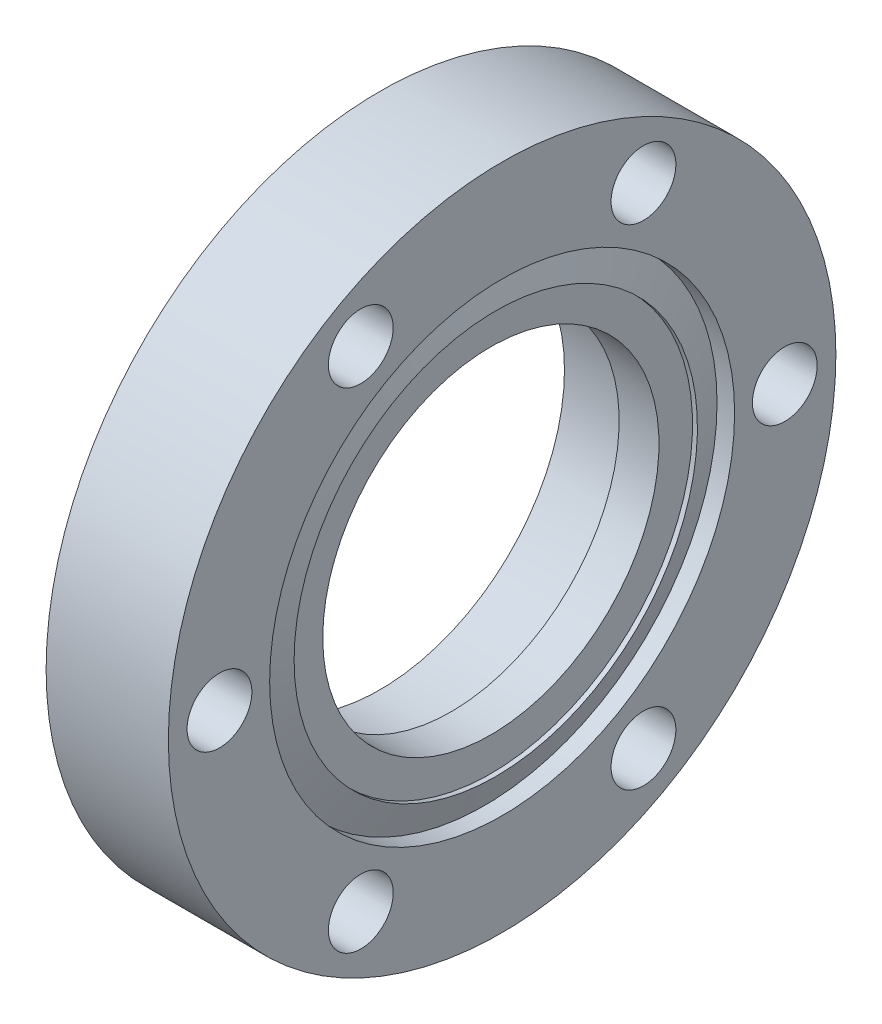
ISO-10303-21;
HEADER;
FILE_DESCRIPTION(('STEP AP214'),'2;1');
FILE_NAME('part.step','',(''),(''),'','','');
FILE_SCHEMA(('AUTOMOTIVE_DESIGN { 1 0 10303 214 1 1 1 1 }'));
ENDSEC;
DATA;
#1=APPLICATION_CONTEXT('core data for automotive mechanical design processes');
#2=APPLICATION_PROTOCOL_DEFINITION('international standard','automotive_design',2000,#1);
#3=PRODUCT_CONTEXT('',#1,'mechanical');
#4=PRODUCT('Part','Part','',(#3));
#5=PRODUCT_RELATED_PRODUCT_CATEGORY('part','',(#4));
#6=PRODUCT_DEFINITION_FORMATION('','',#4);
#7=PRODUCT_DEFINITION_CONTEXT('part definition',#1,'design');
#8=PRODUCT_DEFINITION('design','',#6,#7);
#9=PRODUCT_DEFINITION_SHAPE('','',#8);
#10=(LENGTH_UNIT() NAMED_UNIT(*) SI_UNIT(.MILLI.,.METRE.));
#11=(NAMED_UNIT(*) PLANE_ANGLE_UNIT() SI_UNIT($,.RADIAN.));
#12=(NAMED_UNIT(*) SI_UNIT($,.STERADIAN.) SOLID_ANGLE_UNIT());
#13=UNCERTAINTY_MEASURE_WITH_UNIT(LENGTH_MEASURE(1.E-05),#10,'distance_accuracy_value','');
#14=(GEOMETRIC_REPRESENTATION_CONTEXT(3) GLOBAL_UNCERTAINTY_ASSIGNED_CONTEXT((#13)) GLOBAL_UNIT_ASSIGNED_CONTEXT((#10,
#11,#12)) REPRESENTATION_CONTEXT('',''));
#15=CARTESIAN_POINT('',(0.,0.,0.));
#16=DIRECTION('',(0.,0.,1.));
#17=DIRECTION('',(1.,0.,0.));
#18=AXIS2_PLACEMENT_3D('',#15,#16,#17);
#19=CARTESIAN_POINT('',(5.18000000000051,-19.2062500000005,0.));
#20=DIRECTION('',(1.,0.,0.));
#21=DIRECTION('',(0.,0.,-1.));
#22=AXIS2_PLACEMENT_3D('',#19,#20,#21);
#23=PLANE('',#22);
#24=CARTESIAN_POINT('',(5.18000000000051,0.,0.));
#25=DIRECTION('',(-1.,0.,0.));
#26=DIRECTION('',(0.,0.,1.));
#27=AXIS2_PLACEMENT_3D('',#24,#25,#26);
#28=CIRCLE('',#27,17.4625);
#29=CARTESIAN_POINT('',(5.18000000000051,0.,17.4625));
#30=VERTEX_POINT('',#29);
#31=EDGE_CURVE('E18',#30,#30,#28,.T.);
#32=ORIENTED_EDGE('',*,*,#31,.T.);
#33=EDGE_LOOP('',(#32));
#34=FACE_BOUND('',#33,.T.);
#35=CARTESIAN_POINT('',(5.18000000000051,0.,0.));
#36=DIRECTION('',(-1.,0.,0.));
#37=DIRECTION('',(0.,0.,1.));
#38=AXIS2_PLACEMENT_3D('',#35,#36,#37);
#39=CIRCLE('',#38,20.950000000001);
#40=CARTESIAN_POINT('',(5.18000000000051,0.,20.950000000001));
#41=VERTEX_POINT('',#40);
#42=EDGE_CURVE('E81',#41,#41,#39,.F.);
#43=ORIENTED_EDGE('',*,*,#42,.T.);
#44=EDGE_LOOP('',(#43));
#45=FACE_BOUND('',#44,.T.);
#46=ADVANCED_FACE('F14',(#34,#45),#23,.T.);
#47=CARTESIAN_POINT('',(3.11069999999995,0.,0.));
#48=DIRECTION('',(-1.,0.,0.));
#49=DIRECTION('',(0.,0.,1.));
#50=AXIS2_PLACEMENT_3D('',#47,#48,#49);
#51=CYLINDRICAL_SURFACE('',#50,17.4625);
#52=CARTESIAN_POINT('',(1.04139999999939,0.,0.));
#53=DIRECTION('',(-1.,0.,0.));
#54=DIRECTION('',(0.,0.,1.));
#55=AXIS2_PLACEMENT_3D('',#52,#53,#54);
#56=CIRCLE('',#55,17.4625);
#57=CARTESIAN_POINT('',(1.04139999999939,0.,17.4625));
#58=VERTEX_POINT('',#57);
#59=EDGE_CURVE('E79',#58,#58,#56,.F.);
#60=ORIENTED_EDGE('',*,*,#59,.F.);
#61=EDGE_LOOP('',(#60));
#62=FACE_BOUND('',#61,.T.);
#63=ORIENTED_EDGE('',*,*,#31,.F.);
#64=EDGE_LOOP('',(#63));
#65=FACE_BOUND('',#64,.T.);
#66=ADVANCED_FACE('F89',(#62,#65),#51,.F.);
#67=CARTESIAN_POINT('',(5.43499999999988,0.,0.));
#68=DIRECTION('',(-1.,0.,0.));
#69=DIRECTION('',(0.,0.,1.));
#70=AXIS2_PLACEMENT_3D('',#67,#68,#69);
#71=CYLINDRICAL_SURFACE('',#70,20.950000000001);
#72=ORIENTED_EDGE('',*,*,#42,.F.);
#73=EDGE_LOOP('',(#72));
#74=FACE_BOUND('',#73,.T.);
#75=CARTESIAN_POINT('',(5.69000000223288,0.,0.));
#76=DIRECTION('',(-1.,0.,0.));
#77=DIRECTION('',(0.,-1.,0.));
#78=AXIS2_PLACEMENT_3D('',#75,#76,#77);
#79=CIRCLE('',#78,20.950000000814);
#80=CARTESIAN_POINT('',(5.69000000223288,-20.950000000814,0.));
#81=VERTEX_POINT('',#80);
#82=EDGE_CURVE('E78',#81,#81,#79,.T.);
#83=ORIENTED_EDGE('',*,*,#82,.F.);
#84=EDGE_LOOP('',(#83));
#85=FACE_BOUND('',#84,.T.);
#86=ADVANCED_FACE('F91',(#74,#85),#71,.F.);
#87=CARTESIAN_POINT('',(1.04139999999939,-18.3197499999999,0.));
#88=DIRECTION('',(-1.,0.,0.));
#89=DIRECTION('',(0.,0.,1.));
#90=AXIS2_PLACEMENT_3D('',#87,#88,#89);
#91=PLANE('',#90);
#92=ORIENTED_EDGE('',*,*,#59,.T.);
#93=EDGE_LOOP('',(#92));
#94=FACE_BOUND('',#93,.T.);
#95=CARTESIAN_POINT('',(1.04139999999939,0.,0.));
#96=DIRECTION('',(-1.,0.,0.));
#97=DIRECTION('',(0.,0.,1.));
#98=AXIS2_PLACEMENT_3D('',#95,#96,#97);
#99=CIRCLE('',#98,19.1769999999999);
#100=CARTESIAN_POINT('',(1.04139999999939,0.,19.1769999999999));
#101=VERTEX_POINT('',#100);
#102=EDGE_CURVE('E75',#101,#101,#99,.T.);
#103=ORIENTED_EDGE('',*,*,#102,.T.);
#104=EDGE_LOOP('',(#103));
#105=FACE_BOUND('',#104,.T.);
#106=ADVANCED_FACE('F100',(#94,#105),#91,.T.);
#107=CARTESIAN_POINT('',(4.52529524811392,0.,0.));
#108=DIRECTION('',(-1.,0.,0.));
#109=DIRECTION('',(0.,0.,1.));
#110=AXIS2_PLACEMENT_3D('',#107,#108,#109);
#111=CONICAL_SURFACE('',#110,24.1499999991873,1.22173047499998);
#112=ORIENTED_EDGE('',*,*,#82,.T.);
#113=EDGE_LOOP('',(#112));
#114=FACE_BOUND('',#113,.T.);
#115=CARTESIAN_POINT('',(4.52529525034756,0.,0.));
#116=DIRECTION('',(-1.,0.,0.));
#117=DIRECTION('',(0.,0.,1.));
#118=AXIS2_PLACEMENT_3D('',#115,#116,#117);
#119=CIRCLE('',#118,24.1500000000003);
#120=CARTESIAN_POINT('',(4.52529525034756,0.,24.1500000000003));
#121=VERTEX_POINT('',#120);
#122=EDGE_CURVE('E74',#121,#121,#119,.F.);
#123=ORIENTED_EDGE('',*,*,#122,.T.);
#124=EDGE_LOOP('',(#123));
#125=FACE_BOUND('',#124,.T.);
#126=ADVANCED_FACE('F130',(#114,#125),#111,.T.);
#127=CARTESIAN_POINT('',(-2.65429999999995,0.,0.));
#128=DIRECTION('',(-1.,0.,0.));
#129=DIRECTION('',(0.,0.,1.));
#130=AXIS2_PLACEMENT_3D('',#127,#128,#129);
#131=CYLINDRICAL_SURFACE('',#130,19.1769999999999);
#132=CARTESIAN_POINT('',(-6.34999999999929,0.,0.));
#133=DIRECTION('',(-1.,0.,0.));
#134=DIRECTION('',(0.,0.,1.));
#135=AXIS2_PLACEMENT_3D('',#132,#133,#134);
#136=CIRCLE('',#135,19.1769999999999);
#137=CARTESIAN_POINT('',(-6.34999999999929,0.,19.1769999999999));
#138=VERTEX_POINT('',#137);
#139=EDGE_CURVE('E53',#138,#138,#136,.F.);
#140=ORIENTED_EDGE('',*,*,#139,.F.);
#141=EDGE_LOOP('',(#140));
#142=FACE_BOUND('',#141,.T.);
#143=ORIENTED_EDGE('',*,*,#102,.F.);
#144=EDGE_LOOP('',(#143));
#145=FACE_BOUND('',#144,.T.);
#146=ADVANCED_FACE('F126',(#142,#145),#131,.F.);
#147=CARTESIAN_POINT('',(6.34999999999939,-25.4285843160799,14.6811999999998));
#148=DIRECTION('',(-1.,0.,0.));
#149=DIRECTION('',(0.,0.,1.));
#150=AXIS2_PLACEMENT_3D('',#147,#148,#149);
#151=CYLINDRICAL_SURFACE('',#150,3.36550000000002);
#152=CARTESIAN_POINT('',(6.34999999999937,-25.4285843160799,14.6811999999998));
#153=DIRECTION('',(-1.,0.,0.));
#154=DIRECTION('',(0.,0.,1.));
#155=AXIS2_PLACEMENT_3D('',#152,#153,#154);
#156=CIRCLE('',#155,3.36550000000002);
#157=CARTESIAN_POINT('',(6.34999999999937,-25.4285843160799,18.0466999999999));
#158=VERTEX_POINT('',#157);
#159=EDGE_CURVE('E50',#158,#158,#156,.T.);
#160=ORIENTED_EDGE('',*,*,#159,.F.);
#161=EDGE_LOOP('',(#160));
#162=FACE_BOUND('',#161,.T.);
#163=CARTESIAN_POINT('',(-6.34999999999929,-25.4285843160799,14.6811999999998));
#164=DIRECTION('',(-1.,0.,0.));
#165=DIRECTION('',(0.,0.,1.));
#166=AXIS2_PLACEMENT_3D('',#163,#164,#165);
#167=CIRCLE('',#166,3.36550000000002);
#168=CARTESIAN_POINT('',(-6.34999999999929,-25.4285843160799,18.0466999999999));
#169=VERTEX_POINT('',#168);
#170=EDGE_CURVE('E71',#169,#169,#167,.F.);
#171=ORIENTED_EDGE('',*,*,#170,.F.);
#172=EDGE_LOOP('',(#171));
#173=FACE_BOUND('',#172,.T.);
#174=ADVANCED_FACE('F129',(#162,#173),#151,.F.);
#175=CARTESIAN_POINT('',(6.34999999999939,0.,29.3623999999996));
#176=DIRECTION('',(-1.,0.,0.));
#177=DIRECTION('',(0.,0.,1.));
#178=AXIS2_PLACEMENT_3D('',#175,#176,#177);
#179=CYLINDRICAL_SURFACE('',#178,3.3655);
#180=CARTESIAN_POINT('',(6.34999999999937,0.,29.3623999999996));
#181=DIRECTION('',(-1.,0.,0.));
#182=DIRECTION('',(0.,0.,1.));
#183=AXIS2_PLACEMENT_3D('',#180,#181,#182);
#184=CIRCLE('',#183,3.3655);
#185=CARTESIAN_POINT('',(6.34999999999937,0.,32.7278999999996));
#186=VERTEX_POINT('',#185);
#187=EDGE_CURVE('E47',#186,#186,#184,.T.);
#188=ORIENTED_EDGE('',*,*,#187,.F.);
#189=EDGE_LOOP('',(#188));
#190=FACE_BOUND('',#189,.T.);
#191=CARTESIAN_POINT('',(-6.34999999999929,0.,29.3623999999996));
#192=DIRECTION('',(-1.,0.,0.));
#193=DIRECTION('',(0.,0.,1.));
#194=AXIS2_PLACEMENT_3D('',#191,#192,#193);
#195=CIRCLE('',#194,3.3655);
#196=CARTESIAN_POINT('',(-6.34999999999929,0.,32.7278999999996));
#197=VERTEX_POINT('',#196);
#198=EDGE_CURVE('E68',#197,#197,#195,.F.);
#199=ORIENTED_EDGE('',*,*,#198,.F.);
#200=EDGE_LOOP('',(#199));
#201=FACE_BOUND('',#200,.T.);
#202=ADVANCED_FACE('F214',(#190,#201),#179,.F.);
#203=CARTESIAN_POINT('',(6.34999999999939,25.4285843160799,14.6811999999998));
#204=DIRECTION('',(-1.,0.,0.));
#205=DIRECTION('',(0.,0.,1.));
#206=AXIS2_PLACEMENT_3D('',#203,#204,#205);
#207=CYLINDRICAL_SURFACE('',#206,3.36549999999999);
#208=CARTESIAN_POINT('',(6.34999999999937,25.4285843160799,14.6811999999998));
#209=DIRECTION('',(-1.,0.,0.));
#210=DIRECTION('',(0.,0.,1.));
#211=AXIS2_PLACEMENT_3D('',#208,#209,#210);
#212=CIRCLE('',#211,3.36549999999999);
#213=CARTESIAN_POINT('',(6.34999999999937,25.4285843160799,18.0466999999998));
#214=VERTEX_POINT('',#213);
#215=EDGE_CURVE('E44',#214,#214,#212,.T.);
#216=ORIENTED_EDGE('',*,*,#215,.F.);
#217=EDGE_LOOP('',(#216));
#218=FACE_BOUND('',#217,.T.);
#219=CARTESIAN_POINT('',(-6.34999999999929,25.4285843160799,14.6811999999998));
#220=DIRECTION('',(-1.,0.,0.));
#221=DIRECTION('',(0.,0.,1.));
#222=AXIS2_PLACEMENT_3D('',#219,#220,#221);
#223=CIRCLE('',#222,3.36549999999999);
#224=CARTESIAN_POINT('',(-6.34999999999929,25.4285843160799,18.0466999999998));
#225=VERTEX_POINT('',#224);
#226=EDGE_CURVE('E65',#225,#225,#223,.F.);
#227=ORIENTED_EDGE('',*,*,#226,.F.);
#228=EDGE_LOOP('',(#227));
#229=FACE_BOUND('',#228,.T.);
#230=ADVANCED_FACE('F223',(#218,#229),#207,.F.);
#231=CARTESIAN_POINT('',(6.34999999999939,25.4285843160799,-14.6811999999998));
#232=DIRECTION('',(-1.,0.,0.));
#233=DIRECTION('',(0.,0.,1.));
#234=AXIS2_PLACEMENT_3D('',#231,#232,#233);
#235=CYLINDRICAL_SURFACE('',#234,3.3655);
#236=CARTESIAN_POINT('',(6.34999999999937,25.4285843160799,-14.6811999999998));
#237=DIRECTION('',(-1.,0.,0.));
#238=DIRECTION('',(0.,0.,1.));
#239=AXIS2_PLACEMENT_3D('',#236,#237,#238);
#240=CIRCLE('',#239,3.3655);
#241=CARTESIAN_POINT('',(6.34999999999937,25.4285843160799,-11.3156999999998));
#242=VERTEX_POINT('',#241);
#243=EDGE_CURVE('E41',#242,#242,#240,.T.);
#244=ORIENTED_EDGE('',*,*,#243,.F.);
#245=EDGE_LOOP('',(#244));
#246=FACE_BOUND('',#245,.T.);
#247=CARTESIAN_POINT('',(-6.34999999999929,25.4285843160799,-14.6811999999998));
#248=DIRECTION('',(-1.,0.,0.));
#249=DIRECTION('',(0.,0.,1.));
#250=AXIS2_PLACEMENT_3D('',#247,#248,#249);
#251=CIRCLE('',#250,3.3655);
#252=CARTESIAN_POINT('',(-6.34999999999929,25.4285843160799,-11.3156999999998));
#253=VERTEX_POINT('',#252);
#254=EDGE_CURVE('E62',#253,#253,#251,.F.);
#255=ORIENTED_EDGE('',*,*,#254,.F.);
#256=EDGE_LOOP('',(#255));
#257=FACE_BOUND('',#256,.T.);
#258=ADVANCED_FACE('F232',(#246,#257),#235,.F.);
#259=CARTESIAN_POINT('',(6.34999999999939,-25.4285843160799,-14.6811999999998));
#260=DIRECTION('',(-1.,0.,0.));
#261=DIRECTION('',(0.,0.,1.));
#262=AXIS2_PLACEMENT_3D('',#259,#260,#261);
#263=CYLINDRICAL_SURFACE('',#262,3.3655);
#264=CARTESIAN_POINT('',(6.34999999999937,-25.4285843160799,-14.6811999999998));
#265=DIRECTION('',(-1.,0.,0.));
#266=DIRECTION('',(0.,0.,1.));
#267=AXIS2_PLACEMENT_3D('',#264,#265,#266);
#268=CIRCLE('',#267,3.3655);
#269=CARTESIAN_POINT('',(6.34999999999937,-25.4285843160799,-11.3156999999998));
#270=VERTEX_POINT('',#269);
#271=EDGE_CURVE('E38',#270,#270,#268,.T.);
#272=ORIENTED_EDGE('',*,*,#271,.F.);
#273=EDGE_LOOP('',(#272));
#274=FACE_BOUND('',#273,.T.);
#275=CARTESIAN_POINT('',(-6.34999999999929,-25.4285843160799,-14.6811999999998));
#276=DIRECTION('',(-1.,0.,0.));
#277=DIRECTION('',(0.,0.,1.));
#278=AXIS2_PLACEMENT_3D('',#275,#276,#277);
#279=CIRCLE('',#278,3.3655);
#280=CARTESIAN_POINT('',(-6.34999999999929,-25.4285843160799,-11.3156999999998));
#281=VERTEX_POINT('',#280);
#282=EDGE_CURVE('E59',#281,#281,#279,.F.);
#283=ORIENTED_EDGE('',*,*,#282,.F.);
#284=EDGE_LOOP('',(#283));
#285=FACE_BOUND('',#284,.T.);
#286=ADVANCED_FACE('F241',(#274,#285),#263,.F.);
#287=CARTESIAN_POINT('',(6.34999999999939,0.,-29.3623999999996));
#288=DIRECTION('',(-1.,0.,0.));
#289=DIRECTION('',(0.,0.,1.));
#290=AXIS2_PLACEMENT_3D('',#287,#288,#289);
#291=CYLINDRICAL_SURFACE('',#290,3.3655);
#292=CARTESIAN_POINT('',(6.34999999999937,0.,-29.3623999999996));
#293=DIRECTION('',(-1.,0.,0.));
#294=DIRECTION('',(0.,0.,1.));
#295=AXIS2_PLACEMENT_3D('',#292,#293,#294);
#296=CIRCLE('',#295,3.3655);
#297=CARTESIAN_POINT('',(6.34999999999937,0.,-25.9968999999996));
#298=VERTEX_POINT('',#297);
#299=EDGE_CURVE('E35',#298,#298,#296,.T.);
#300=ORIENTED_EDGE('',*,*,#299,.F.);
#301=EDGE_LOOP('',(#300));
#302=FACE_BOUND('',#301,.T.);
#303=CARTESIAN_POINT('',(-6.34999999999929,0.,-29.3623999999996));
#304=DIRECTION('',(-1.,0.,0.));
#305=DIRECTION('',(0.,0.,1.));
#306=AXIS2_PLACEMENT_3D('',#303,#304,#305);
#307=CIRCLE('',#306,3.3655);
#308=CARTESIAN_POINT('',(-6.34999999999929,0.,-25.9968999999996));
#309=VERTEX_POINT('',#308);
#310=EDGE_CURVE('E56',#309,#309,#307,.F.);
#311=ORIENTED_EDGE('',*,*,#310,.F.);
#312=EDGE_LOOP('',(#311));
#313=FACE_BOUND('',#312,.T.);
#314=ADVANCED_FACE('F16',(#302,#313),#291,.F.);
#315=CARTESIAN_POINT('',(5.43764762517347,0.,0.));
#316=DIRECTION('',(-1.,0.,0.));
#317=DIRECTION('',(0.,0.,1.));
#318=AXIS2_PLACEMENT_3D('',#315,#316,#317);
#319=CYLINDRICAL_SURFACE('',#318,24.1500000000003);
#320=ORIENTED_EDGE('',*,*,#122,.F.);
#321=EDGE_LOOP('',(#320));
#322=FACE_BOUND('',#321,.T.);
#323=CARTESIAN_POINT('',(6.34999999999937,0.,0.));
#324=DIRECTION('',(-1.,0.,0.));
#325=DIRECTION('',(0.,0.,1.));
#326=AXIS2_PLACEMENT_3D('',#323,#324,#325);
#327=CIRCLE('',#326,24.1500000000003);
#328=CARTESIAN_POINT('',(6.34999999999937,0.,24.1500000000003));
#329=VERTEX_POINT('',#328);
#330=EDGE_CURVE('E27',#329,#329,#327,.T.);
#331=ORIENTED_EDGE('',*,*,#330,.F.);
#332=EDGE_LOOP('',(#331));
#333=FACE_BOUND('',#332,.T.);
#334=ADVANCED_FACE('F121',(#322,#333),#319,.F.);
#335=CARTESIAN_POINT('',(-6.34999999999929,-26.9240000000001,0.));
#336=DIRECTION('',(-1.,0.,0.));
#337=DIRECTION('',(0.,0.,1.));
#338=AXIS2_PLACEMENT_3D('',#335,#336,#337);
#339=PLANE('',#338);
#340=ORIENTED_EDGE('',*,*,#139,.T.);
#341=EDGE_LOOP('',(#340));
#342=FACE_BOUND('',#341,.T.);
#343=ORIENTED_EDGE('',*,*,#310,.T.);
#344=EDGE_LOOP('',(#343));
#345=FACE_BOUND('',#344,.T.);
#346=ORIENTED_EDGE('',*,*,#282,.T.);
#347=EDGE_LOOP('',(#346));
#348=FACE_BOUND('',#347,.T.);
#349=ORIENTED_EDGE('',*,*,#254,.T.);
#350=EDGE_LOOP('',(#349));
#351=FACE_BOUND('',#350,.T.);
#352=ORIENTED_EDGE('',*,*,#226,.T.);
#353=EDGE_LOOP('',(#352));
#354=FACE_BOUND('',#353,.T.);
#355=ORIENTED_EDGE('',*,*,#198,.T.);
#356=EDGE_LOOP('',(#355));
#357=FACE_BOUND('',#356,.T.);
#358=ORIENTED_EDGE('',*,*,#170,.T.);
#359=EDGE_LOOP('',(#358));
#360=FACE_BOUND('',#359,.T.);
#361=CARTESIAN_POINT('',(-6.34999999999929,0.,0.));
#362=DIRECTION('',(-1.,0.,0.));
#363=DIRECTION('',(0.,0.,1.));
#364=AXIS2_PLACEMENT_3D('',#361,#362,#363);
#365=CIRCLE('',#364,34.6710000000003);
#366=CARTESIAN_POINT('',(-6.34999999999929,0.,34.6710000000003));
#367=VERTEX_POINT('',#366);
#368=EDGE_CURVE('E22',#367,#367,#365,.F.);
#369=ORIENTED_EDGE('',*,*,#368,.F.);
#370=EDGE_LOOP('',(#369));
#371=FACE_BOUND('',#370,.T.);
#372=ADVANCED_FACE('F114',(#342,#345,#348,#351,#354,#357,#360,#371),#339,.T.);
#373=CARTESIAN_POINT('',(6.34999999999937,-29.4105000000003,0.));
#374=DIRECTION('',(1.,0.,0.));
#375=DIRECTION('',(0.,0.,-1.));
#376=AXIS2_PLACEMENT_3D('',#373,#374,#375);
#377=PLANE('',#376);
#378=ORIENTED_EDGE('',*,*,#330,.T.);
#379=EDGE_LOOP('',(#378));
#380=FACE_BOUND('',#379,.T.);
#381=ORIENTED_EDGE('',*,*,#299,.T.);
#382=EDGE_LOOP('',(#381));
#383=FACE_BOUND('',#382,.T.);
#384=ORIENTED_EDGE('',*,*,#271,.T.);
#385=EDGE_LOOP('',(#384));
#386=FACE_BOUND('',#385,.T.);
#387=ORIENTED_EDGE('',*,*,#243,.T.);
#388=EDGE_LOOP('',(#387));
#389=FACE_BOUND('',#388,.T.);
#390=ORIENTED_EDGE('',*,*,#215,.T.);
#391=EDGE_LOOP('',(#390));
#392=FACE_BOUND('',#391,.T.);
#393=ORIENTED_EDGE('',*,*,#187,.T.);
#394=EDGE_LOOP('',(#393));
#395=FACE_BOUND('',#394,.T.);
#396=ORIENTED_EDGE('',*,*,#159,.T.);
#397=EDGE_LOOP('',(#396));
#398=FACE_BOUND('',#397,.T.);
#399=CARTESIAN_POINT('',(6.34999999999937,0.,0.));
#400=DIRECTION('',(-1.,0.,0.));
#401=DIRECTION('',(0.,0.,1.));
#402=AXIS2_PLACEMENT_3D('',#399,#400,#401);
#403=CIRCLE('',#402,34.6710000000003);
#404=CARTESIAN_POINT('',(6.34999999999937,0.,34.6710000000003));
#405=VERTEX_POINT('',#404);
#406=EDGE_CURVE('E10',#405,#405,#403,.T.);
#407=ORIENTED_EDGE('',*,*,#406,.F.);
#408=EDGE_LOOP('',(#407));
#409=FACE_BOUND('',#408,.T.);
#410=ADVANCED_FACE('F107',(#380,#383,#386,#389,#392,#395,#398,#409),#377,.T.);
#411=CARTESIAN_POINT('',(0.,0.,0.));
#412=DIRECTION('',(-1.,0.,0.));
#413=DIRECTION('',(0.,0.,1.));
#414=AXIS2_PLACEMENT_3D('',#411,#412,#413);
#415=CYLINDRICAL_SURFACE('',#414,34.6710000000003);
#416=ORIENTED_EDGE('',*,*,#406,.T.);
#417=EDGE_LOOP('',(#416));
#418=FACE_BOUND('',#417,.T.);
#419=ORIENTED_EDGE('',*,*,#368,.T.);
#420=EDGE_LOOP('',(#419));
#421=FACE_BOUND('',#420,.T.);
#422=ADVANCED_FACE('F105',(#418,#421),#415,.T.);
#423=CLOSED_SHELL('',(#46,#66,#86,#106,#126,#146,#174,#202,#230,#258,#286,#314,#334,#372,#410,#422));
#424=MANIFOLD_SOLID_BREP('B1',#423);
#425=ADVANCED_BREP_SHAPE_REPRESENTATION('',(#18,#424),#14);
#426=SHAPE_DEFINITION_REPRESENTATION(#9,#425);
ENDSEC;
END-ISO-10303-21;
